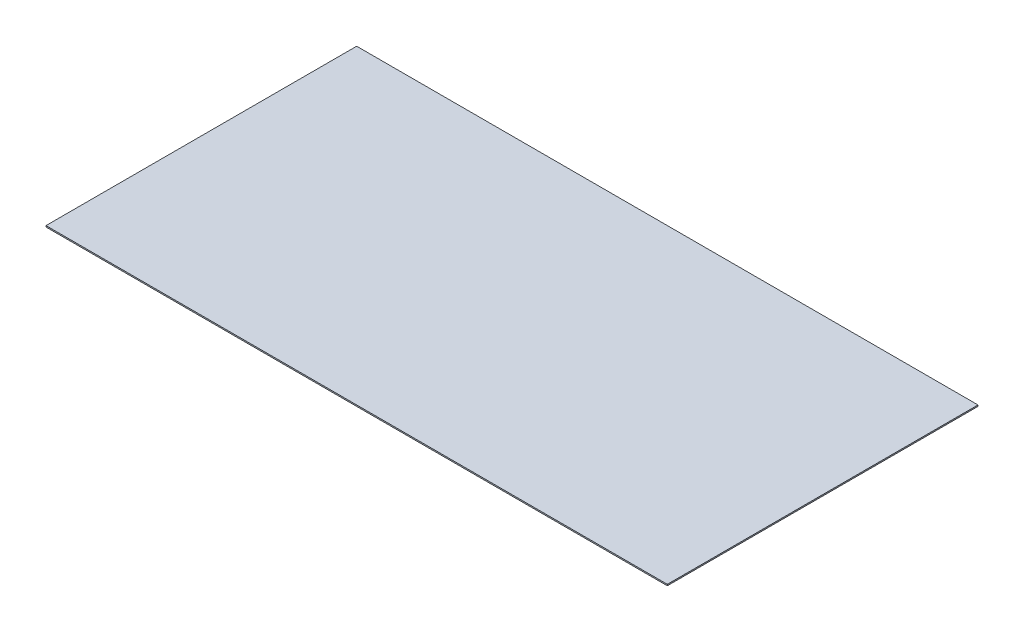
ISO-10303-21;
HEADER;
FILE_DESCRIPTION(('STEP AP214'),'2;1');
FILE_NAME('part.step','',(''),(''),'','','');
FILE_SCHEMA(('AUTOMOTIVE_DESIGN { 1 0 10303 214 1 1 1 1 }'));
ENDSEC;
DATA;
#1=APPLICATION_CONTEXT('core data for automotive mechanical design processes');
#2=APPLICATION_PROTOCOL_DEFINITION('international standard','automotive_design',2000,#1);
#3=PRODUCT_CONTEXT('',#1,'mechanical');
#4=PRODUCT('Part','Part','',(#3));
#5=PRODUCT_RELATED_PRODUCT_CATEGORY('part','',(#4));
#6=PRODUCT_DEFINITION_FORMATION('','',#4);
#7=PRODUCT_DEFINITION_CONTEXT('part definition',#1,'design');
#8=PRODUCT_DEFINITION('design','',#6,#7);
#9=PRODUCT_DEFINITION_SHAPE('','',#8);
#10=(LENGTH_UNIT() NAMED_UNIT(*) SI_UNIT(.MILLI.,.METRE.));
#11=(NAMED_UNIT(*) PLANE_ANGLE_UNIT() SI_UNIT($,.RADIAN.));
#12=(NAMED_UNIT(*) SI_UNIT($,.STERADIAN.) SOLID_ANGLE_UNIT());
#13=UNCERTAINTY_MEASURE_WITH_UNIT(LENGTH_MEASURE(1.E-05),#10,'distance_accuracy_value','');
#14=(GEOMETRIC_REPRESENTATION_CONTEXT(3) GLOBAL_UNCERTAINTY_ASSIGNED_CONTEXT((#13)) GLOBAL_UNIT_ASSIGNED_CONTEXT((#10,
#11,#12)) REPRESENTATION_CONTEXT('',''));
#15=CARTESIAN_POINT('',(0.,0.,0.));
#16=DIRECTION('',(0.,0.,1.));
#17=DIRECTION('',(1.,0.,0.));
#18=AXIS2_PLACEMENT_3D('',#15,#16,#17);
#19=CARTESIAN_POINT('',(0.,2.54,0.));
#20=DIRECTION('',(0.,1.,0.));
#21=DIRECTION('',(0.,0.,1.));
#22=AXIS2_PLACEMENT_3D('',#19,#20,#21);
#23=PLANE('',#22);
#24=DIRECTION('',(0.,0.,1.));
#25=VECTOR('',#24,1.);
#26=CARTESIAN_POINT('',(609.6,2.54,304.8));
#27=LINE('',#26,#25);
#28=CARTESIAN_POINT('',(609.6,2.54,304.8));
#29=VERTEX_POINT('',#28);
#30=CARTESIAN_POINT('',(609.6,2.54,-304.8));
#31=VERTEX_POINT('',#30);
#32=EDGE_CURVE('E55',#29,#31,#27,.F.);
#33=ORIENTED_EDGE('',*,*,#32,.T.);
#34=DIRECTION('',(1.,0.,0.));
#35=VECTOR('',#34,1.);
#36=CARTESIAN_POINT('',(609.6,2.54,-304.8));
#37=LINE('',#36,#35);
#38=CARTESIAN_POINT('',(-609.6,2.54,-304.8));
#39=VERTEX_POINT('',#38);
#40=EDGE_CURVE('E76',#31,#39,#37,.F.);
#41=ORIENTED_EDGE('',*,*,#40,.T.);
#42=DIRECTION('',(0.,0.,-1.));
#43=VECTOR('',#42,1.);
#44=CARTESIAN_POINT('',(-609.6,2.54,304.8));
#45=LINE('',#44,#43);
#46=CARTESIAN_POINT('',(-609.6,2.54,304.8));
#47=VERTEX_POINT('',#46);
#48=EDGE_CURVE('E58',#39,#47,#45,.F.);
#49=ORIENTED_EDGE('',*,*,#48,.T.);
#50=DIRECTION('',(-1.,0.,0.));
#51=VECTOR('',#50,1.);
#52=CARTESIAN_POINT('',(609.6,2.54,304.8));
#53=LINE('',#52,#51);
#54=EDGE_CURVE('E20',#47,#29,#53,.F.);
#55=ORIENTED_EDGE('',*,*,#54,.T.);
#56=EDGE_LOOP('',(#33,#41,#49,#55));
#57=FACE_BOUND('',#56,.T.);
#58=ADVANCED_FACE('F17',(#57),#23,.T.);
#59=CARTESIAN_POINT('',(609.6,2.54,304.8));
#60=DIRECTION('',(0.,0.,-1.));
#61=DIRECTION('',(-1.,0.,0.));
#62=AXIS2_PLACEMENT_3D('',#59,#60,#61);
#63=PLANE('',#62);
#64=DIRECTION('',(0.,1.,0.));
#65=VECTOR('',#64,1.);
#66=CARTESIAN_POINT('',(609.6,2.54,304.8));
#67=LINE('',#66,#65);
#68=CARTESIAN_POINT('',(609.6,0.,304.8));
#69=VERTEX_POINT('',#68);
#70=EDGE_CURVE('E63',#69,#29,#67,.T.);
#71=ORIENTED_EDGE('',*,*,#70,.T.);
#72=ORIENTED_EDGE('',*,*,#54,.F.);
#73=DIRECTION('',(0.,1.,0.));
#74=VECTOR('',#73,1.);
#75=CARTESIAN_POINT('',(-609.6,2.54,304.8));
#76=LINE('',#75,#74);
#77=CARTESIAN_POINT('',(-609.6,0.,304.8));
#78=VERTEX_POINT('',#77);
#79=EDGE_CURVE('E80',#47,#78,#76,.F.);
#80=ORIENTED_EDGE('',*,*,#79,.T.);
#81=DIRECTION('',(1.,0.,0.));
#82=VECTOR('',#81,1.);
#83=CARTESIAN_POINT('',(0.,0.,304.8));
#84=LINE('',#83,#82);
#85=EDGE_CURVE('E73',#78,#69,#84,.T.);
#86=ORIENTED_EDGE('',*,*,#85,.T.);
#87=EDGE_LOOP('',(#71,#72,#80,#86));
#88=FACE_BOUND('',#87,.T.);
#89=ADVANCED_FACE('F72',(#88),#63,.F.);
#90=CARTESIAN_POINT('',(609.6,2.54,304.8));
#91=DIRECTION('',(-1.,0.,0.));
#92=DIRECTION('',(0.,0.,1.));
#93=AXIS2_PLACEMENT_3D('',#90,#91,#92);
#94=PLANE('',#93);
#95=DIRECTION('',(0.,1.,0.));
#96=VECTOR('',#95,1.);
#97=CARTESIAN_POINT('',(609.6,2.54,-304.8));
#98=LINE('',#97,#96);
#99=CARTESIAN_POINT('',(609.6,0.,-304.8));
#100=VERTEX_POINT('',#99);
#101=EDGE_CURVE('E69',#100,#31,#98,.T.);
#102=ORIENTED_EDGE('',*,*,#101,.T.);
#103=ORIENTED_EDGE('',*,*,#32,.F.);
#104=ORIENTED_EDGE('',*,*,#70,.F.);
#105=DIRECTION('',(0.,0.,1.));
#106=VECTOR('',#105,1.);
#107=CARTESIAN_POINT('',(609.6,0.,0.));
#108=LINE('',#107,#106);
#109=EDGE_CURVE('E83',#69,#100,#108,.F.);
#110=ORIENTED_EDGE('',*,*,#109,.T.);
#111=EDGE_LOOP('',(#102,#103,#104,#110));
#112=FACE_BOUND('',#111,.T.);
#113=ADVANCED_FACE('F66',(#112),#94,.F.);
#114=CARTESIAN_POINT('',(609.6,2.54,-304.8));
#115=DIRECTION('',(0.,0.,1.));
#116=DIRECTION('',(1.,0.,0.));
#117=AXIS2_PLACEMENT_3D('',#114,#115,#116);
#118=PLANE('',#117);
#119=DIRECTION('',(0.,1.,0.));
#120=VECTOR('',#119,1.);
#121=CARTESIAN_POINT('',(-609.6,2.54,-304.8));
#122=LINE('',#121,#120);
#123=CARTESIAN_POINT('',(-609.6,0.,-304.8));
#124=VERTEX_POINT('',#123);
#125=EDGE_CURVE('E34',#124,#39,#122,.T.);
#126=ORIENTED_EDGE('',*,*,#125,.T.);
#127=ORIENTED_EDGE('',*,*,#40,.F.);
#128=ORIENTED_EDGE('',*,*,#101,.F.);
#129=DIRECTION('',(1.,0.,0.));
#130=VECTOR('',#129,1.);
#131=CARTESIAN_POINT('',(0.,0.,-304.8));
#132=LINE('',#131,#130);
#133=EDGE_CURVE('E26',#100,#124,#132,.F.);
#134=ORIENTED_EDGE('',*,*,#133,.T.);
#135=EDGE_LOOP('',(#126,#127,#128,#134));
#136=FACE_BOUND('',#135,.T.);
#137=ADVANCED_FACE('F88',(#136),#118,.F.);
#138=CARTESIAN_POINT('',(-609.6,2.54,304.8));
#139=DIRECTION('',(1.,0.,0.));
#140=DIRECTION('',(0.,0.,-1.));
#141=AXIS2_PLACEMENT_3D('',#138,#139,#140);
#142=PLANE('',#141);
#143=ORIENTED_EDGE('',*,*,#79,.F.);
#144=ORIENTED_EDGE('',*,*,#48,.F.);
#145=ORIENTED_EDGE('',*,*,#125,.F.);
#146=DIRECTION('',(0.,0.,1.));
#147=VECTOR('',#146,1.);
#148=CARTESIAN_POINT('',(-609.6,0.,0.));
#149=LINE('',#148,#147);
#150=EDGE_CURVE('E11',#124,#78,#149,.T.);
#151=ORIENTED_EDGE('',*,*,#150,.T.);
#152=EDGE_LOOP('',(#143,#144,#145,#151));
#153=FACE_BOUND('',#152,.T.);
#154=ADVANCED_FACE('F91',(#153),#142,.F.);
#155=CARTESIAN_POINT('',(0.,0.,0.));
#156=DIRECTION('',(0.,1.,0.));
#157=DIRECTION('',(0.,0.,1.));
#158=AXIS2_PLACEMENT_3D('',#155,#156,#157);
#159=PLANE('',#158);
#160=ORIENTED_EDGE('',*,*,#133,.F.);
#161=ORIENTED_EDGE('',*,*,#109,.F.);
#162=ORIENTED_EDGE('',*,*,#85,.F.);
#163=ORIENTED_EDGE('',*,*,#150,.F.);
#164=EDGE_LOOP('',(#160,#161,#162,#163));
#165=FACE_BOUND('',#164,.T.);
#166=ADVANCED_FACE('F90',(#165),#159,.F.);
#167=CLOSED_SHELL('',(#58,#89,#113,#137,#154,#166));
#168=MANIFOLD_SOLID_BREP('B1',#167);
#169=ADVANCED_BREP_SHAPE_REPRESENTATION('',(#18,#168),#14);
#170=SHAPE_DEFINITION_REPRESENTATION(#9,#169);
ENDSEC;
END-ISO-10303-21;
